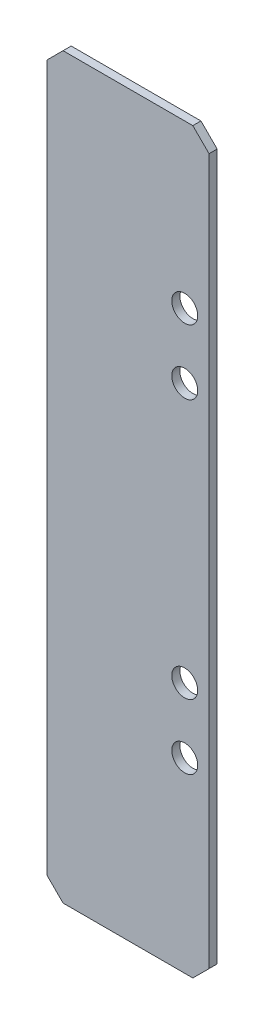
ISO-10303-21;
HEADER;
FILE_DESCRIPTION(('STEP AP214'),'2;1');
FILE_NAME('part.step','',(''),(''),'','','');
FILE_SCHEMA(('AUTOMOTIVE_DESIGN { 1 0 10303 214 1 1 1 1 }'));
ENDSEC;
DATA;
#1=APPLICATION_CONTEXT('core data for automotive mechanical design processes');
#2=APPLICATION_PROTOCOL_DEFINITION('international standard','automotive_design',2000,#1);
#3=PRODUCT_CONTEXT('',#1,'mechanical');
#4=PRODUCT('Part','Part','',(#3));
#5=PRODUCT_RELATED_PRODUCT_CATEGORY('part','',(#4));
#6=PRODUCT_DEFINITION_FORMATION('','',#4);
#7=PRODUCT_DEFINITION_CONTEXT('part definition',#1,'design');
#8=PRODUCT_DEFINITION('design','',#6,#7);
#9=PRODUCT_DEFINITION_SHAPE('','',#8);
#10=(LENGTH_UNIT() NAMED_UNIT(*) SI_UNIT(.MILLI.,.METRE.));
#11=(NAMED_UNIT(*) PLANE_ANGLE_UNIT() SI_UNIT($,.RADIAN.));
#12=(NAMED_UNIT(*) SI_UNIT($,.STERADIAN.) SOLID_ANGLE_UNIT());
#13=UNCERTAINTY_MEASURE_WITH_UNIT(LENGTH_MEASURE(1.E-05),#10,'distance_accuracy_value','');
#14=(GEOMETRIC_REPRESENTATION_CONTEXT(3) GLOBAL_UNCERTAINTY_ASSIGNED_CONTEXT((#13)) GLOBAL_UNIT_ASSIGNED_CONTEXT((#10,
#11,#12)) REPRESENTATION_CONTEXT('',''));
#15=CARTESIAN_POINT('',(0.,0.,0.));
#16=DIRECTION('',(0.,0.,1.));
#17=DIRECTION('',(1.,0.,0.));
#18=AXIS2_PLACEMENT_3D('',#15,#16,#17);
#19=CARTESIAN_POINT('',(0.,0.,1.));
#20=DIRECTION('',(0.,0.,1.));
#21=DIRECTION('',(1.,0.,0.));
#22=AXIS2_PLACEMENT_3D('',#19,#20,#21);
#23=PLANE('',#22);
#24=CARTESIAN_POINT('',(7.00000000000042,-14.5,1.));
#25=DIRECTION('',(0.,0.,1.));
#26=DIRECTION('',(1.,0.,0.));
#27=AXIS2_PLACEMENT_3D('',#24,#25,#26);
#28=CIRCLE('',#27,1.6);
#29=CARTESIAN_POINT('',(8.60000000000042,-14.5,1.));
#30=VERTEX_POINT('',#29);
#31=EDGE_CURVE('E191',#30,#30,#28,.T.);
#32=ORIENTED_EDGE('',*,*,#31,.F.);
#33=EDGE_LOOP('',(#32));
#34=FACE_BOUND('',#33,.T.);
#35=CARTESIAN_POINT('',(7.,25.5,1.));
#36=DIRECTION('',(0.,0.,1.));
#37=DIRECTION('',(1.,0.,0.));
#38=AXIS2_PLACEMENT_3D('',#35,#36,#37);
#39=CIRCLE('',#38,1.6);
#40=CARTESIAN_POINT('',(8.6,25.5,1.));
#41=VERTEX_POINT('',#40);
#42=EDGE_CURVE('E177',#41,#41,#39,.T.);
#43=ORIENTED_EDGE('',*,*,#42,.F.);
#44=EDGE_LOOP('',(#43));
#45=FACE_BOUND('',#44,.T.);
#46=DIRECTION('',(-1.,0.,0.));
#47=VECTOR('',#46,1.);
#48=CARTESIAN_POINT('',(-10.,45.5,1.));
#49=LINE('',#48,#47);
#50=CARTESIAN_POINT('',(8.00000000000001,45.5,1.));
#51=VERTEX_POINT('',#50);
#52=CARTESIAN_POINT('',(-8.,45.5,1.));
#53=VERTEX_POINT('',#52);
#54=EDGE_CURVE('E172',#51,#53,#49,.T.);
#55=ORIENTED_EDGE('',*,*,#54,.T.);
#56=DIRECTION('',(0.70710678118655,0.707106781186545,0.));
#57=VECTOR('',#56,1.);
#58=CARTESIAN_POINT('',(-26.75,26.7500000000002,1.));
#59=LINE('',#58,#57);
#60=CARTESIAN_POINT('',(-10.,43.5,1.));
#61=VERTEX_POINT('',#60);
#62=EDGE_CURVE('E153',#53,#61,#59,.F.);
#63=ORIENTED_EDGE('',*,*,#62,.T.);
#64=DIRECTION('',(0.,-1.,0.));
#65=VECTOR('',#64,1.);
#66=CARTESIAN_POINT('',(-10.,45.5,1.));
#67=LINE('',#66,#65);
#68=CARTESIAN_POINT('',(-10.,-43.5,1.));
#69=VERTEX_POINT('',#68);
#70=EDGE_CURVE('E123',#61,#69,#67,.T.);
#71=ORIENTED_EDGE('',*,*,#70,.T.);
#72=DIRECTION('',(-0.707106781186545,0.70710678118655,0.));
#73=VECTOR('',#72,1.);
#74=CARTESIAN_POINT('',(-26.75,-26.7499999999999,1.));
#75=LINE('',#74,#73);
#76=CARTESIAN_POINT('',(-8.00000000000001,-45.5,1.));
#77=VERTEX_POINT('',#76);
#78=EDGE_CURVE('E59',#69,#77,#75,.F.);
#79=ORIENTED_EDGE('',*,*,#78,.T.);
#80=DIRECTION('',(1.,0.,0.));
#81=VECTOR('',#80,1.);
#82=CARTESIAN_POINT('',(-10.,-45.5,1.));
#83=LINE('',#82,#81);
#84=CARTESIAN_POINT('',(8.,-45.5,1.));
#85=VERTEX_POINT('',#84);
#86=EDGE_CURVE('E139',#77,#85,#83,.T.);
#87=ORIENTED_EDGE('',*,*,#86,.T.);
#88=DIRECTION('',(-0.70710678118655,-0.707106781186545,0.));
#89=VECTOR('',#88,1.);
#90=CARTESIAN_POINT('',(26.75,-26.7500000000002,1.));
#91=LINE('',#90,#89);
#92=CARTESIAN_POINT('',(10.,-43.5,1.));
#93=VERTEX_POINT('',#92);
#94=EDGE_CURVE('E150',#85,#93,#91,.F.);
#95=ORIENTED_EDGE('',*,*,#94,.T.);
#96=DIRECTION('',(0.,1.,0.));
#97=VECTOR('',#96,1.);
#98=CARTESIAN_POINT('',(10.,45.5,1.));
#99=LINE('',#98,#97);
#100=CARTESIAN_POINT('',(10.,43.5,1.));
#101=VERTEX_POINT('',#100);
#102=EDGE_CURVE('E133',#93,#101,#99,.T.);
#103=ORIENTED_EDGE('',*,*,#102,.T.);
#104=DIRECTION('',(0.707106781186545,-0.70710678118655,0.));
#105=VECTOR('',#104,1.);
#106=CARTESIAN_POINT('',(26.75,26.7499999999999,1.));
#107=LINE('',#106,#105);
#108=EDGE_CURVE('E148',#101,#51,#107,.F.);
#109=ORIENTED_EDGE('',*,*,#108,.T.);
#110=EDGE_LOOP('',(#55,#63,#71,#79,#87,#95,#103,#109));
#111=FACE_BOUND('',#110,.T.);
#112=CARTESIAN_POINT('',(7.,17.5,1.));
#113=DIRECTION('',(0.,0.,1.));
#114=DIRECTION('',(1.,0.,0.));
#115=AXIS2_PLACEMENT_3D('',#112,#113,#114);
#116=CIRCLE('',#115,1.6);
#117=CARTESIAN_POINT('',(8.6,17.5,1.));
#118=VERTEX_POINT('',#117);
#119=EDGE_CURVE('E186',#118,#118,#116,.T.);
#120=ORIENTED_EDGE('',*,*,#119,.F.);
#121=EDGE_LOOP('',(#120));
#122=FACE_BOUND('',#121,.T.);
#123=CARTESIAN_POINT('',(7.00000000000042,-22.5,1.));
#124=DIRECTION('',(0.,0.,1.));
#125=DIRECTION('',(1.,0.,0.));
#126=AXIS2_PLACEMENT_3D('',#123,#124,#125);
#127=CIRCLE('',#126,1.6);
#128=CARTESIAN_POINT('',(8.60000000000042,-22.5,1.));
#129=VERTEX_POINT('',#128);
#130=EDGE_CURVE('E197',#129,#129,#127,.T.);
#131=ORIENTED_EDGE('',*,*,#130,.F.);
#132=EDGE_LOOP('',(#131));
#133=FACE_BOUND('',#132,.T.);
#134=ADVANCED_FACE('F36',(#34,#45,#111,#122,#133),#23,.T.);
#135=CARTESIAN_POINT('',(0.,0.,0.));
#136=DIRECTION('',(0.,0.,1.));
#137=DIRECTION('',(1.,0.,0.));
#138=AXIS2_PLACEMENT_3D('',#135,#136,#137);
#139=PLANE('',#138);
#140=DIRECTION('',(0.,-1.,0.));
#141=VECTOR('',#140,1.);
#142=CARTESIAN_POINT('',(-10.,45.5,0.));
#143=LINE('',#142,#141);
#144=CARTESIAN_POINT('',(-10.,43.5,0.));
#145=VERTEX_POINT('',#144);
#146=CARTESIAN_POINT('',(-10.,-43.5,0.));
#147=VERTEX_POINT('',#146);
#148=EDGE_CURVE('E121',#145,#147,#143,.T.);
#149=ORIENTED_EDGE('',*,*,#148,.F.);
#150=DIRECTION('',(-0.70710678118655,-0.707106781186545,0.));
#151=VECTOR('',#150,1.);
#152=CARTESIAN_POINT('',(-10.,43.5,0.));
#153=LINE('',#152,#151);
#154=CARTESIAN_POINT('',(-8.,45.5,0.));
#155=VERTEX_POINT('',#154);
#156=EDGE_CURVE('E104',#145,#155,#153,.F.);
#157=ORIENTED_EDGE('',*,*,#156,.T.);
#158=DIRECTION('',(-1.,0.,0.));
#159=VECTOR('',#158,1.);
#160=CARTESIAN_POINT('',(-10.,45.5,0.));
#161=LINE('',#160,#159);
#162=CARTESIAN_POINT('',(8.00000000000001,45.5,0.));
#163=VERTEX_POINT('',#162);
#164=EDGE_CURVE('E131',#163,#155,#161,.T.);
#165=ORIENTED_EDGE('',*,*,#164,.F.);
#166=DIRECTION('',(-0.707106781186545,0.70710678118655,0.));
#167=VECTOR('',#166,1.);
#168=CARTESIAN_POINT('',(8.00000000000001,45.5,0.));
#169=LINE('',#168,#167);
#170=CARTESIAN_POINT('',(10.,43.5,0.));
#171=VERTEX_POINT('',#170);
#172=EDGE_CURVE('E124',#163,#171,#169,.F.);
#173=ORIENTED_EDGE('',*,*,#172,.T.);
#174=DIRECTION('',(0.,1.,0.));
#175=VECTOR('',#174,1.);
#176=CARTESIAN_POINT('',(10.,45.5,0.));
#177=LINE('',#176,#175);
#178=CARTESIAN_POINT('',(10.,-43.5,0.));
#179=VERTEX_POINT('',#178);
#180=EDGE_CURVE('E135',#179,#171,#177,.T.);
#181=ORIENTED_EDGE('',*,*,#180,.F.);
#182=DIRECTION('',(0.70710678118655,0.707106781186545,0.));
#183=VECTOR('',#182,1.);
#184=CARTESIAN_POINT('',(10.,-43.5,0.));
#185=LINE('',#184,#183);
#186=CARTESIAN_POINT('',(8.,-45.5,0.));
#187=VERTEX_POINT('',#186);
#188=EDGE_CURVE('E142',#179,#187,#185,.F.);
#189=ORIENTED_EDGE('',*,*,#188,.T.);
#190=DIRECTION('',(1.,0.,0.));
#191=VECTOR('',#190,1.);
#192=CARTESIAN_POINT('',(-10.,-45.5,0.));
#193=LINE('',#192,#191);
#194=CARTESIAN_POINT('',(-8.00000000000001,-45.5,0.));
#195=VERTEX_POINT('',#194);
#196=EDGE_CURVE('E130',#195,#187,#193,.T.);
#197=ORIENTED_EDGE('',*,*,#196,.F.);
#198=DIRECTION('',(0.707106781186545,-0.70710678118655,0.));
#199=VECTOR('',#198,1.);
#200=CARTESIAN_POINT('',(-8.00000000000001,-45.5,0.));
#201=LINE('',#200,#199);
#202=EDGE_CURVE('E115',#195,#147,#201,.F.);
#203=ORIENTED_EDGE('',*,*,#202,.T.);
#204=EDGE_LOOP('',(#149,#157,#165,#173,#181,#189,#197,#203));
#205=FACE_BOUND('',#204,.T.);
#206=CARTESIAN_POINT('',(7.,25.5,0.));
#207=DIRECTION('',(0.,0.,1.));
#208=DIRECTION('',(1.,0.,0.));
#209=AXIS2_PLACEMENT_3D('',#206,#207,#208);
#210=CIRCLE('',#209,1.6);
#211=CARTESIAN_POINT('',(8.6,25.5,0.));
#212=VERTEX_POINT('',#211);
#213=EDGE_CURVE('E179',#212,#212,#210,.T.);
#214=ORIENTED_EDGE('',*,*,#213,.T.);
#215=EDGE_LOOP('',(#214));
#216=FACE_BOUND('',#215,.T.);
#217=CARTESIAN_POINT('',(7.,17.5,0.));
#218=DIRECTION('',(0.,0.,1.));
#219=DIRECTION('',(1.,0.,0.));
#220=AXIS2_PLACEMENT_3D('',#217,#218,#219);
#221=CIRCLE('',#220,1.6);
#222=CARTESIAN_POINT('',(8.6,17.5,0.));
#223=VERTEX_POINT('',#222);
#224=EDGE_CURVE('E188',#223,#223,#221,.T.);
#225=ORIENTED_EDGE('',*,*,#224,.T.);
#226=EDGE_LOOP('',(#225));
#227=FACE_BOUND('',#226,.T.);
#228=CARTESIAN_POINT('',(7.00000000000042,-14.5,0.));
#229=DIRECTION('',(0.,0.,1.));
#230=DIRECTION('',(1.,0.,0.));
#231=AXIS2_PLACEMENT_3D('',#228,#229,#230);
#232=CIRCLE('',#231,1.6);
#233=CARTESIAN_POINT('',(8.60000000000042,-14.5,0.));
#234=VERTEX_POINT('',#233);
#235=EDGE_CURVE('E194',#234,#234,#232,.T.);
#236=ORIENTED_EDGE('',*,*,#235,.T.);
#237=EDGE_LOOP('',(#236));
#238=FACE_BOUND('',#237,.T.);
#239=CARTESIAN_POINT('',(7.00000000000042,-22.5,0.));
#240=DIRECTION('',(0.,0.,1.));
#241=DIRECTION('',(1.,0.,0.));
#242=AXIS2_PLACEMENT_3D('',#239,#240,#241);
#243=CIRCLE('',#242,1.6);
#244=CARTESIAN_POINT('',(8.60000000000042,-22.5,0.));
#245=VERTEX_POINT('',#244);
#246=EDGE_CURVE('E200',#245,#245,#243,.T.);
#247=ORIENTED_EDGE('',*,*,#246,.T.);
#248=EDGE_LOOP('',(#247));
#249=FACE_BOUND('',#248,.T.);
#250=ADVANCED_FACE('F127',(#205,#216,#227,#238,#249),#139,.F.);
#251=CARTESIAN_POINT('',(10.,45.5,1.));
#252=DIRECTION('',(-1.,0.,0.));
#253=DIRECTION('',(0.,0.,1.));
#254=AXIS2_PLACEMENT_3D('',#251,#252,#253);
#255=PLANE('',#254);
#256=ORIENTED_EDGE('',*,*,#102,.F.);
#257=DIRECTION('',(0.,0.,-1.));
#258=VECTOR('',#257,1.);
#259=CARTESIAN_POINT('',(10.,-43.5,1.));
#260=LINE('',#259,#258);
#261=EDGE_CURVE('E11',#93,#179,#260,.T.);
#262=ORIENTED_EDGE('',*,*,#261,.T.);
#263=ORIENTED_EDGE('',*,*,#180,.T.);
#264=DIRECTION('',(0.,0.,1.));
#265=VECTOR('',#264,1.);
#266=CARTESIAN_POINT('',(10.,43.5,1.));
#267=LINE('',#266,#265);
#268=EDGE_CURVE('E45',#171,#101,#267,.T.);
#269=ORIENTED_EDGE('',*,*,#268,.T.);
#270=EDGE_LOOP('',(#256,#262,#263,#269));
#271=FACE_BOUND('',#270,.T.);
#272=ADVANCED_FACE('F163',(#271),#255,.F.);
#273=CARTESIAN_POINT('',(-10.,45.5,1.));
#274=DIRECTION('',(0.,-1.,0.));
#275=DIRECTION('',(0.,0.,-1.));
#276=AXIS2_PLACEMENT_3D('',#273,#274,#275);
#277=PLANE('',#276);
#278=ORIENTED_EDGE('',*,*,#164,.T.);
#279=DIRECTION('',(0.,0.,1.));
#280=VECTOR('',#279,1.);
#281=CARTESIAN_POINT('',(-8.,45.5,1.));
#282=LINE('',#281,#280);
#283=EDGE_CURVE('E109',#155,#53,#282,.T.);
#284=ORIENTED_EDGE('',*,*,#283,.T.);
#285=ORIENTED_EDGE('',*,*,#54,.F.);
#286=DIRECTION('',(0.,0.,-1.));
#287=VECTOR('',#286,1.);
#288=CARTESIAN_POINT('',(8.00000000000001,45.5,1.));
#289=LINE('',#288,#287);
#290=EDGE_CURVE('E114',#51,#163,#289,.T.);
#291=ORIENTED_EDGE('',*,*,#290,.T.);
#292=EDGE_LOOP('',(#278,#284,#285,#291));
#293=FACE_BOUND('',#292,.T.);
#294=ADVANCED_FACE('F176',(#293),#277,.F.);
#295=CARTESIAN_POINT('',(-10.,45.5,1.));
#296=DIRECTION('',(1.,0.,0.));
#297=DIRECTION('',(0.,0.,-1.));
#298=AXIS2_PLACEMENT_3D('',#295,#296,#297);
#299=PLANE('',#298);
#300=ORIENTED_EDGE('',*,*,#70,.F.);
#301=DIRECTION('',(0.,0.,-1.));
#302=VECTOR('',#301,1.);
#303=CARTESIAN_POINT('',(-10.,43.5,1.));
#304=LINE('',#303,#302);
#305=EDGE_CURVE('E108',#61,#145,#304,.T.);
#306=ORIENTED_EDGE('',*,*,#305,.T.);
#307=ORIENTED_EDGE('',*,*,#148,.T.);
#308=DIRECTION('',(0.,0.,1.));
#309=VECTOR('',#308,1.);
#310=CARTESIAN_POINT('',(-10.,-43.5,1.));
#311=LINE('',#310,#309);
#312=EDGE_CURVE('E125',#147,#69,#311,.T.);
#313=ORIENTED_EDGE('',*,*,#312,.T.);
#314=EDGE_LOOP('',(#300,#306,#307,#313));
#315=FACE_BOUND('',#314,.T.);
#316=ADVANCED_FACE('F120',(#315),#299,.F.);
#317=CARTESIAN_POINT('',(-10.,-45.5,1.));
#318=DIRECTION('',(0.,1.,0.));
#319=DIRECTION('',(0.,0.,1.));
#320=AXIS2_PLACEMENT_3D('',#317,#318,#319);
#321=PLANE('',#320);
#322=ORIENTED_EDGE('',*,*,#86,.F.);
#323=DIRECTION('',(0.,0.,-1.));
#324=VECTOR('',#323,1.);
#325=CARTESIAN_POINT('',(-8.00000000000001,-45.5,1.));
#326=LINE('',#325,#324);
#327=EDGE_CURVE('E156',#77,#195,#326,.T.);
#328=ORIENTED_EDGE('',*,*,#327,.T.);
#329=ORIENTED_EDGE('',*,*,#196,.T.);
#330=DIRECTION('',(0.,0.,1.));
#331=VECTOR('',#330,1.);
#332=CARTESIAN_POINT('',(8.,-45.5,1.));
#333=LINE('',#332,#331);
#334=EDGE_CURVE('E52',#187,#85,#333,.T.);
#335=ORIENTED_EDGE('',*,*,#334,.T.);
#336=EDGE_LOOP('',(#322,#328,#329,#335));
#337=FACE_BOUND('',#336,.T.);
#338=ADVANCED_FACE('F222',(#337),#321,.F.);
#339=CARTESIAN_POINT('',(7.,25.5,1.));
#340=DIRECTION('',(0.,0.,-1.));
#341=DIRECTION('',(-1.,0.,0.));
#342=AXIS2_PLACEMENT_3D('',#339,#340,#341);
#343=CYLINDRICAL_SURFACE('',#342,1.6);
#344=ORIENTED_EDGE('',*,*,#42,.T.);
#345=EDGE_LOOP('',(#344));
#346=FACE_BOUND('',#345,.T.);
#347=ORIENTED_EDGE('',*,*,#213,.F.);
#348=EDGE_LOOP('',(#347));
#349=FACE_BOUND('',#348,.T.);
#350=ADVANCED_FACE('F219',(#346,#349),#343,.F.);
#351=CARTESIAN_POINT('',(7.,17.5,1.));
#352=DIRECTION('',(0.,0.,-1.));
#353=DIRECTION('',(-1.,0.,0.));
#354=AXIS2_PLACEMENT_3D('',#351,#352,#353);
#355=CYLINDRICAL_SURFACE('',#354,1.6);
#356=ORIENTED_EDGE('',*,*,#119,.T.);
#357=EDGE_LOOP('',(#356));
#358=FACE_BOUND('',#357,.T.);
#359=ORIENTED_EDGE('',*,*,#224,.F.);
#360=EDGE_LOOP('',(#359));
#361=FACE_BOUND('',#360,.T.);
#362=ADVANCED_FACE('F323',(#358,#361),#355,.F.);
#363=CARTESIAN_POINT('',(7.00000000000042,-14.5,1.));
#364=DIRECTION('',(0.,0.,-1.));
#365=DIRECTION('',(-1.,0.,0.));
#366=AXIS2_PLACEMENT_3D('',#363,#364,#365);
#367=CYLINDRICAL_SURFACE('',#366,1.6);
#368=ORIENTED_EDGE('',*,*,#31,.T.);
#369=EDGE_LOOP('',(#368));
#370=FACE_BOUND('',#369,.T.);
#371=ORIENTED_EDGE('',*,*,#235,.F.);
#372=EDGE_LOOP('',(#371));
#373=FACE_BOUND('',#372,.T.);
#374=ADVANCED_FACE('F314',(#370,#373),#367,.F.);
#375=CARTESIAN_POINT('',(7.00000000000042,-22.5,1.));
#376=DIRECTION('',(0.,0.,-1.));
#377=DIRECTION('',(-1.,0.,0.));
#378=AXIS2_PLACEMENT_3D('',#375,#376,#377);
#379=CYLINDRICAL_SURFACE('',#378,1.6);
#380=ORIENTED_EDGE('',*,*,#130,.T.);
#381=EDGE_LOOP('',(#380));
#382=FACE_BOUND('',#381,.T.);
#383=ORIENTED_EDGE('',*,*,#246,.F.);
#384=EDGE_LOOP('',(#383));
#385=FACE_BOUND('',#384,.T.);
#386=ADVANCED_FACE('F206',(#382,#385),#379,.F.);
#387=CARTESIAN_POINT('',(-10.,43.5,1.));
#388=DIRECTION('',(0.707106781186545,-0.70710678118655,0.));
#389=DIRECTION('',(0.,0.,-1.));
#390=AXIS2_PLACEMENT_3D('',#387,#388,#389);
#391=PLANE('',#390);
#392=ORIENTED_EDGE('',*,*,#62,.F.);
#393=ORIENTED_EDGE('',*,*,#283,.F.);
#394=ORIENTED_EDGE('',*,*,#156,.F.);
#395=ORIENTED_EDGE('',*,*,#305,.F.);
#396=EDGE_LOOP('',(#392,#393,#394,#395));
#397=FACE_BOUND('',#396,.T.);
#398=ADVANCED_FACE('F107',(#397),#391,.F.);
#399=CARTESIAN_POINT('',(-8.00000000000001,-45.5,1.));
#400=DIRECTION('',(0.70710678118655,0.707106781186545,0.));
#401=DIRECTION('',(0.,0.,-1.));
#402=AXIS2_PLACEMENT_3D('',#399,#400,#401);
#403=PLANE('',#402);
#404=ORIENTED_EDGE('',*,*,#78,.F.);
#405=ORIENTED_EDGE('',*,*,#312,.F.);
#406=ORIENTED_EDGE('',*,*,#202,.F.);
#407=ORIENTED_EDGE('',*,*,#327,.F.);
#408=EDGE_LOOP('',(#404,#405,#406,#407));
#409=FACE_BOUND('',#408,.T.);
#410=ADVANCED_FACE('F237',(#409),#403,.F.);
#411=CARTESIAN_POINT('',(10.,-43.5,1.));
#412=DIRECTION('',(-0.707106781186545,0.70710678118655,0.));
#413=DIRECTION('',(0.,0.,-1.));
#414=AXIS2_PLACEMENT_3D('',#411,#412,#413);
#415=PLANE('',#414);
#416=ORIENTED_EDGE('',*,*,#94,.F.);
#417=ORIENTED_EDGE('',*,*,#334,.F.);
#418=ORIENTED_EDGE('',*,*,#188,.F.);
#419=ORIENTED_EDGE('',*,*,#261,.F.);
#420=EDGE_LOOP('',(#416,#417,#418,#419));
#421=FACE_BOUND('',#420,.T.);
#422=ADVANCED_FACE('F242',(#421),#415,.F.);
#423=CARTESIAN_POINT('',(8.00000000000001,45.5,1.));
#424=DIRECTION('',(-0.70710678118655,-0.707106781186545,0.));
#425=DIRECTION('',(0.,0.,-1.));
#426=AXIS2_PLACEMENT_3D('',#423,#424,#425);
#427=PLANE('',#426);
#428=ORIENTED_EDGE('',*,*,#108,.F.);
#429=ORIENTED_EDGE('',*,*,#268,.F.);
#430=ORIENTED_EDGE('',*,*,#172,.F.);
#431=ORIENTED_EDGE('',*,*,#290,.F.);
#432=EDGE_LOOP('',(#428,#429,#430,#431));
#433=FACE_BOUND('',#432,.T.);
#434=ADVANCED_FACE('F39',(#433),#427,.F.);
#435=CLOSED_SHELL('',(#134,#250,#272,#294,#316,#338,#350,#362,#374,#386,#398,#410,#422,#434));
#436=MANIFOLD_SOLID_BREP('B2',#435);
#437=ADVANCED_BREP_SHAPE_REPRESENTATION('',(#18,#436),#14);
#438=SHAPE_DEFINITION_REPRESENTATION(#9,#437);
ENDSEC;
END-ISO-10303-21;
